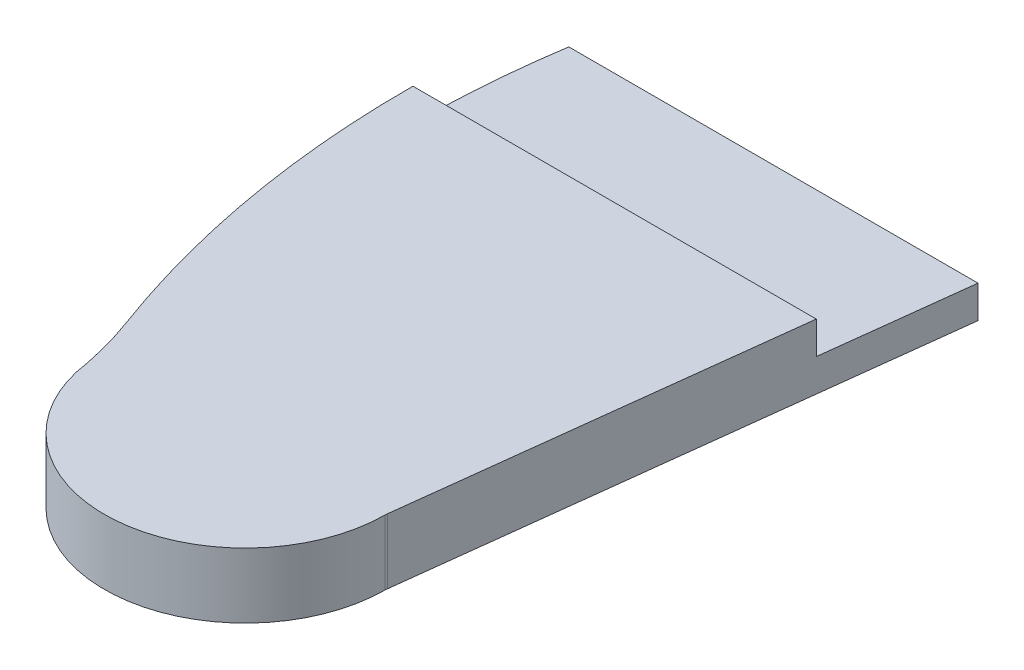
ISO-10303-21;
HEADER;
FILE_DESCRIPTION(('STEP AP214'),'2;1');
FILE_NAME('part.step','',(''),(''),'','','');
FILE_SCHEMA(('AUTOMOTIVE_DESIGN { 1 0 10303 214 1 1 1 1 }'));
ENDSEC;
DATA;
#1=APPLICATION_CONTEXT('core data for automotive mechanical design processes');
#2=APPLICATION_PROTOCOL_DEFINITION('international standard','automotive_design',2000,#1);
#3=PRODUCT_CONTEXT('',#1,'mechanical');
#4=PRODUCT('Part','Part','',(#3));
#5=PRODUCT_RELATED_PRODUCT_CATEGORY('part','',(#4));
#6=PRODUCT_DEFINITION_FORMATION('','',#4);
#7=PRODUCT_DEFINITION_CONTEXT('part definition',#1,'design');
#8=PRODUCT_DEFINITION('design','',#6,#7);
#9=PRODUCT_DEFINITION_SHAPE('','',#8);
#10=(LENGTH_UNIT() NAMED_UNIT(*) SI_UNIT(.MILLI.,.METRE.));
#11=(NAMED_UNIT(*) PLANE_ANGLE_UNIT() SI_UNIT($,.RADIAN.));
#12=(NAMED_UNIT(*) SI_UNIT($,.STERADIAN.) SOLID_ANGLE_UNIT());
#13=UNCERTAINTY_MEASURE_WITH_UNIT(LENGTH_MEASURE(1.E-05),#10,'distance_accuracy_value','');
#14=(GEOMETRIC_REPRESENTATION_CONTEXT(3) GLOBAL_UNCERTAINTY_ASSIGNED_CONTEXT((#13)) GLOBAL_UNIT_ASSIGNED_CONTEXT((#10,
#11,#12)) REPRESENTATION_CONTEXT('',''));
#15=CARTESIAN_POINT('',(0.,0.,0.));
#16=DIRECTION('',(0.,0.,1.));
#17=DIRECTION('',(1.,0.,0.));
#18=AXIS2_PLACEMENT_3D('',#15,#16,#17);
#19=CARTESIAN_POINT('',(113.450621235206,21.75,99.8017663174114));
#20=DIRECTION('',(0.992936608383073,0.,0.118646077612034));
#21=DIRECTION('',(0.118646077612034,0.,-0.992936608383073));
#22=AXIS2_PLACEMENT_3D('',#19,#20,#21);
#23=PLANE('',#22);
#24=DIRECTION('',(0.,-1.,0.));
#25=VECTOR('',#24,1.);
#26=CARTESIAN_POINT('',(105.254766199258,21.75,168.392019497163));
#27=LINE('',#26,#25);
#28=CARTESIAN_POINT('',(105.254766199258,21.75,168.392019497163));
#29=VERTEX_POINT('',#28);
#30=CARTESIAN_POINT('',(105.254766199258,15.,168.392019497163));
#31=VERTEX_POINT('',#30);
#32=EDGE_CURVE('E119',#29,#31,#27,.T.);
#33=ORIENTED_EDGE('',*,*,#32,.F.);
#34=DIRECTION('',(-0.118646077612034,0.,0.992936608383073));
#35=VECTOR('',#34,1.);
#36=CARTESIAN_POINT('',(113.450621235206,21.75,99.8017663174114));
#37=LINE('',#36,#35);
#38=CARTESIAN_POINT('',(95.7499989352653,21.75,247.936422148546));
#39=VERTEX_POINT('',#38);
#40=EDGE_CURVE('E147',#29,#39,#37,.T.);
#41=ORIENTED_EDGE('',*,*,#40,.T.);
#42=DIRECTION('',(0.,-1.,0.));
#43=VECTOR('',#42,1.);
#44=CARTESIAN_POINT('',(95.7499989352653,21.75,247.936422148546));
#45=LINE('',#44,#43);
#46=CARTESIAN_POINT('',(95.7499989352653,8.25,247.936422148546));
#47=VERTEX_POINT('',#46);
#48=EDGE_CURVE('E169',#39,#47,#45,.T.);
#49=ORIENTED_EDGE('',*,*,#48,.T.);
#50=DIRECTION('',(-0.118646077612034,0.,0.992936608383073));
#51=VECTOR('',#50,1.);
#52=CARTESIAN_POINT('',(113.450621235206,8.25,99.8017663174114));
#53=LINE('',#52,#51);
#54=CARTESIAN_POINT('',(108.839468685106,8.25,138.392019497163));
#55=VERTEX_POINT('',#54);
#56=EDGE_CURVE('E164',#55,#47,#53,.T.);
#57=ORIENTED_EDGE('',*,*,#56,.F.);
#58=DIRECTION('',(0.,1.,0.));
#59=VECTOR('',#58,1.);
#60=CARTESIAN_POINT('',(108.839468685106,21.75,138.392019497163));
#61=LINE('',#60,#59);
#62=CARTESIAN_POINT('',(108.839468685106,15.,138.392019497163));
#63=VERTEX_POINT('',#62);
#64=EDGE_CURVE('E62',#55,#63,#61,.T.);
#65=ORIENTED_EDGE('',*,*,#64,.T.);
#66=DIRECTION('',(0.118646077612034,0.,-0.992936608383073));
#67=VECTOR('',#66,1.);
#68=CARTESIAN_POINT('',(113.450621235206,15.,99.8017663174114));
#69=LINE('',#68,#67);
#70=EDGE_CURVE('E55',#31,#63,#69,.T.);
#71=ORIENTED_EDGE('',*,*,#70,.F.);
#72=EDGE_LOOP('',(#33,#41,#49,#57,#65,#71));
#73=FACE_BOUND('',#72,.T.);
#74=ADVANCED_FACE('F40',(#73),#23,.T.);
#75=CARTESIAN_POINT('',(226.607768194537,21.75,169.442885886238));
#76=DIRECTION('',(0.,-1.,0.));
#77=DIRECTION('',(0.,0.,-1.));
#78=AXIS2_PLACEMENT_3D('',#75,#76,#77);
#79=CYLINDRICAL_SURFACE('',#78,205.108590526185);
#80=CARTESIAN_POINT('',(226.607768194537,21.75,169.442885886238));
#81=DIRECTION('',(0.,1.,0.));
#82=DIRECTION('',(0.,0.,1.));
#83=AXIS2_PLACEMENT_3D('',#80,#81,#82);
#84=CIRCLE('',#83,205.108590526185);
#85=CARTESIAN_POINT('',(21.5018697238431,21.75,168.392019497163));
#86=VERTEX_POINT('',#85);
#87=CARTESIAN_POINT('',(34.1785546048209,21.75,240.439587674995));
#88=VERTEX_POINT('',#87);
#89=EDGE_CURVE('E124',#86,#88,#84,.T.);
#90=ORIENTED_EDGE('',*,*,#89,.F.);
#91=DIRECTION('',(0.,-1.,0.));
#92=VECTOR('',#91,1.);
#93=CARTESIAN_POINT('',(21.5018697238431,21.75,168.392019497163));
#94=LINE('',#93,#92);
#95=CARTESIAN_POINT('',(21.5018697238431,15.,168.392019497163));
#96=VERTEX_POINT('',#95);
#97=EDGE_CURVE('E116',#86,#96,#94,.T.);
#98=ORIENTED_EDGE('',*,*,#97,.T.);
#99=CARTESIAN_POINT('',(226.607768194537,15.,169.442885886238));
#100=DIRECTION('',(0.,-1.,0.));
#101=DIRECTION('',(0.,0.,-1.));
#102=AXIS2_PLACEMENT_3D('',#99,#100,#101);
#103=CIRCLE('',#102,205.108590526185);
#104=CARTESIAN_POINT('',(23.8631564187217,15.,138.392019497163));
#105=VERTEX_POINT('',#104);
#106=EDGE_CURVE('E104',#96,#105,#103,.T.);
#107=ORIENTED_EDGE('',*,*,#106,.T.);
#108=DIRECTION('',(0.,-1.,0.));
#109=VECTOR('',#108,1.);
#110=CARTESIAN_POINT('',(23.8631564187217,21.75,138.392019497163));
#111=LINE('',#110,#109);
#112=CARTESIAN_POINT('',(23.8631564187217,8.25,138.392019497163));
#113=VERTEX_POINT('',#112);
#114=EDGE_CURVE('E126',#113,#105,#111,.F.);
#115=ORIENTED_EDGE('',*,*,#114,.F.);
#116=CARTESIAN_POINT('',(226.607768194537,8.25,169.442885886238));
#117=DIRECTION('',(0.,1.,0.));
#118=DIRECTION('',(0.,0.,1.));
#119=AXIS2_PLACEMENT_3D('',#116,#117,#118);
#120=CIRCLE('',#119,205.108590526185);
#121=CARTESIAN_POINT('',(34.1785546048209,8.25,240.439587674995));
#122=VERTEX_POINT('',#121);
#123=EDGE_CURVE('E139',#113,#122,#120,.T.);
#124=ORIENTED_EDGE('',*,*,#123,.T.);
#125=DIRECTION('',(0.,-1.,0.));
#126=VECTOR('',#125,1.);
#127=CARTESIAN_POINT('',(34.1785546048209,21.75,240.439587674995));
#128=LINE('',#127,#126);
#129=EDGE_CURVE('E150',#88,#122,#128,.T.);
#130=ORIENTED_EDGE('',*,*,#129,.F.);
#131=EDGE_LOOP('',(#90,#98,#107,#115,#124,#130));
#132=FACE_BOUND('',#131,.T.);
#133=ADVANCED_FACE('F122',(#132),#79,.T.);
#134=CARTESIAN_POINT('',(37.2193540619975,21.75,90.6928858862381));
#135=DIRECTION('',(0.,1.,0.));
#136=DIRECTION('',(0.,0.,1.));
#137=AXIS2_PLACEMENT_3D('',#134,#135,#136);
#138=PLANE('',#137);
#139=DIRECTION('',(1.,0.,0.));
#140=VECTOR('',#139,1.);
#141=CARTESIAN_POINT('',(21.4991776683519,21.75,168.392019497163));
#142=LINE('',#141,#140);
#143=EDGE_CURVE('E112',#86,#29,#142,.T.);
#144=ORIENTED_EDGE('',*,*,#143,.F.);
#145=ORIENTED_EDGE('',*,*,#89,.T.);
#146=CARTESIAN_POINT('',(37.9207497333752,21.75,254.559964563918));
#147=CARTESIAN_POINT('',(36.7611745636568,21.75,247.335944745943));
#148=CARTESIAN_POINT('',(34.1785546048209,21.75,240.439587674995));
#149=B_SPLINE_CURVE_WITH_KNOTS('',2,(#146,#147,#148),.UNSPECIFIED.,.F.,.F.,(3,3),(0.,1.),.UNSPECIFIED.);
#150=CARTESIAN_POINT('',(37.4786449664301,21.75,252.078923217014));
#151=VERTEX_POINT('',#150);
#152=EDGE_CURVE('E132',#151,#88,#149,.T.);
#153=ORIENTED_EDGE('',*,*,#152,.F.);
#154=CARTESIAN_POINT('',(66.4693540619976,21.75,248.192885886238));
#155=DIRECTION('',(0.,1.,0.));
#156=DIRECTION('',(0.,0.,1.));
#157=AXIS2_PLACEMENT_3D('',#154,#155,#156);
#158=CIRCLE('',#157,29.2500000000001);
#159=CARTESIAN_POINT('',(95.718365724857,21.75,248.433337016259));
#160=VERTEX_POINT('',#159);
#161=EDGE_CURVE('E138',#151,#160,#158,.T.);
#162=ORIENTED_EDGE('',*,*,#161,.T.);
#163=CARTESIAN_POINT('',(100.218213672989,21.75,248.4703294978));
#164=DIRECTION('',(0.,1.,0.));
#165=DIRECTION('',(0.,0.,1.));
#166=AXIS2_PLACEMENT_3D('',#163,#164,#165);
#167=CIRCLE('',#166,4.49999999999999);
#168=EDGE_CURVE('E144',#39,#160,#167,.T.);
#169=ORIENTED_EDGE('',*,*,#168,.F.);
#170=ORIENTED_EDGE('',*,*,#40,.F.);
#171=EDGE_LOOP('',(#144,#145,#153,#162,#169,#170));
#172=FACE_BOUND('',#171,.T.);
#173=ADVANCED_FACE('F186',(#172),#138,.T.);
#174=CARTESIAN_POINT('',(37.2193540619975,8.25,90.6928858862381));
#175=DIRECTION('',(0.,1.,0.));
#176=DIRECTION('',(0.,0.,1.));
#177=AXIS2_PLACEMENT_3D('',#174,#175,#176);
#178=PLANE('',#177);
#179=DIRECTION('',(-1.,0.,0.));
#180=VECTOR('',#179,1.);
#181=CARTESIAN_POINT('',(37.2193540619975,8.25,138.392019497163));
#182=LINE('',#181,#180);
#183=EDGE_CURVE('E49',#55,#113,#182,.T.);
#184=ORIENTED_EDGE('',*,*,#183,.F.);
#185=ORIENTED_EDGE('',*,*,#56,.T.);
#186=CARTESIAN_POINT('',(100.218213672989,8.25,248.4703294978));
#187=DIRECTION('',(0.,1.,0.));
#188=DIRECTION('',(0.,0.,1.));
#189=AXIS2_PLACEMENT_3D('',#186,#187,#188);
#190=CIRCLE('',#189,4.49999999999999);
#191=CARTESIAN_POINT('',(95.718365724857,8.25,248.433337016259));
#192=VERTEX_POINT('',#191);
#193=EDGE_CURVE('E161',#47,#192,#190,.T.);
#194=ORIENTED_EDGE('',*,*,#193,.T.);
#195=CARTESIAN_POINT('',(66.4693540619976,8.25,248.192885886238));
#196=DIRECTION('',(0.,1.,0.));
#197=DIRECTION('',(0.,0.,1.));
#198=AXIS2_PLACEMENT_3D('',#195,#196,#197);
#199=CIRCLE('',#198,29.2500000000001);
#200=CARTESIAN_POINT('',(37.4786449664301,8.25,252.078923217014));
#201=VERTEX_POINT('',#200);
#202=EDGE_CURVE('E155',#201,#192,#199,.T.);
#203=ORIENTED_EDGE('',*,*,#202,.F.);
#204=CARTESIAN_POINT('',(37.9207497333752,8.25,254.559964563918));
#205=CARTESIAN_POINT('',(36.7611745636568,8.25,247.335944745943));
#206=CARTESIAN_POINT('',(34.1785546048209,8.25,240.439587674995));
#207=B_SPLINE_CURVE_WITH_KNOTS('',2,(#204,#205,#206),.UNSPECIFIED.,.F.,.F.,(3,3),(0.,1.),.UNSPECIFIED.);
#208=EDGE_CURVE('E131',#201,#122,#207,.T.);
#209=ORIENTED_EDGE('',*,*,#208,.T.);
#210=ORIENTED_EDGE('',*,*,#123,.F.);
#211=EDGE_LOOP('',(#184,#185,#194,#203,#209,#210));
#212=FACE_BOUND('',#211,.T.);
#213=ADVANCED_FACE('F179',(#212),#178,.F.);
#214=DIRECTION('',(0.,-1.,0.));
#215=VECTOR('',#214,1.);
#216=SURFACE_OF_LINEAR_EXTRUSION('',#149,#215);
#217=ORIENTED_EDGE('',*,*,#208,.F.);
#218=DIRECTION('',(0.,-1.,0.));
#219=VECTOR('',#218,1.);
#220=CARTESIAN_POINT('',(37.4786449664301,21.75,252.078923217014));
#221=LINE('',#220,#219);
#222=EDGE_CURVE('E174',#151,#201,#221,.T.);
#223=ORIENTED_EDGE('',*,*,#222,.F.);
#224=ORIENTED_EDGE('',*,*,#152,.T.);
#225=ORIENTED_EDGE('',*,*,#129,.T.);
#226=EDGE_LOOP('',(#217,#223,#224,#225));
#227=FACE_BOUND('',#226,.T.);
#228=ADVANCED_FACE('F42',(#227),#216,.T.);
#229=CARTESIAN_POINT('',(66.4693540619976,21.75,248.192885886238));
#230=DIRECTION('',(0.,-1.,0.));
#231=DIRECTION('',(0.,0.,-1.));
#232=AXIS2_PLACEMENT_3D('',#229,#230,#231);
#233=CYLINDRICAL_SURFACE('',#232,29.2500000000001);
#234=ORIENTED_EDGE('',*,*,#202,.T.);
#235=DIRECTION('',(0.,-1.,0.));
#236=VECTOR('',#235,1.);
#237=CARTESIAN_POINT('',(95.718365724857,21.75,248.433337016259));
#238=LINE('',#237,#236);
#239=EDGE_CURVE('E172',#160,#192,#238,.T.);
#240=ORIENTED_EDGE('',*,*,#239,.F.);
#241=ORIENTED_EDGE('',*,*,#161,.F.);
#242=ORIENTED_EDGE('',*,*,#222,.T.);
#243=EDGE_LOOP('',(#234,#240,#241,#242));
#244=FACE_BOUND('',#243,.T.);
#245=ADVANCED_FACE('F197',(#244),#233,.T.);
#246=CARTESIAN_POINT('',(100.218213672989,21.75,248.4703294978));
#247=DIRECTION('',(0.,-1.,0.));
#248=DIRECTION('',(0.,0.,-1.));
#249=AXIS2_PLACEMENT_3D('',#246,#247,#248);
#250=CYLINDRICAL_SURFACE('',#249,4.49999999999999);
#251=ORIENTED_EDGE('',*,*,#193,.F.);
#252=ORIENTED_EDGE('',*,*,#48,.F.);
#253=ORIENTED_EDGE('',*,*,#168,.T.);
#254=ORIENTED_EDGE('',*,*,#239,.T.);
#255=EDGE_LOOP('',(#251,#252,#253,#254));
#256=FACE_BOUND('',#255,.T.);
#257=ADVANCED_FACE('F195',(#256),#250,.F.);
#258=CARTESIAN_POINT('',(123.979143601082,21.75,138.392019497163));
#259=DIRECTION('',(0.,0.,-1.));
#260=DIRECTION('',(-1.,0.,0.));
#261=AXIS2_PLACEMENT_3D('',#258,#259,#260);
#262=PLANE('',#261);
#263=DIRECTION('',(-1.,0.,0.));
#264=VECTOR('',#263,1.);
#265=CARTESIAN_POINT('',(123.979143601082,15.,138.392019497163));
#266=LINE('',#265,#264);
#267=EDGE_CURVE('E11',#63,#105,#266,.T.);
#268=ORIENTED_EDGE('',*,*,#267,.F.);
#269=ORIENTED_EDGE('',*,*,#64,.F.);
#270=ORIENTED_EDGE('',*,*,#183,.T.);
#271=ORIENTED_EDGE('',*,*,#114,.T.);
#272=EDGE_LOOP('',(#268,#269,#270,#271));
#273=FACE_BOUND('',#272,.T.);
#274=ADVANCED_FACE('F175',(#273),#262,.T.);
#275=CARTESIAN_POINT('',(21.4991776683519,15.,168.392019497163));
#276=DIRECTION('',(0.,0.,1.));
#277=DIRECTION('',(1.,0.,0.));
#278=AXIS2_PLACEMENT_3D('',#275,#276,#277);
#279=PLANE('',#278);
#280=ORIENTED_EDGE('',*,*,#32,.T.);
#281=DIRECTION('',(1.,0.,0.));
#282=VECTOR('',#281,1.);
#283=CARTESIAN_POINT('',(21.4991776683519,15.,168.392019497163));
#284=LINE('',#283,#282);
#285=EDGE_CURVE('E107',#96,#31,#284,.T.);
#286=ORIENTED_EDGE('',*,*,#285,.F.);
#287=ORIENTED_EDGE('',*,*,#97,.F.);
#288=ORIENTED_EDGE('',*,*,#143,.T.);
#289=EDGE_LOOP('',(#280,#286,#287,#288));
#290=FACE_BOUND('',#289,.T.);
#291=ADVANCED_FACE('F115',(#290),#279,.F.);
#292=CARTESIAN_POINT('',(21.4991776683519,15.,168.392019497163));
#293=DIRECTION('',(0.,-1.,0.));
#294=DIRECTION('',(0.,0.,-1.));
#295=AXIS2_PLACEMENT_3D('',#292,#293,#294);
#296=PLANE('',#295);
#297=ORIENTED_EDGE('',*,*,#70,.T.);
#298=ORIENTED_EDGE('',*,*,#267,.T.);
#299=ORIENTED_EDGE('',*,*,#106,.F.);
#300=ORIENTED_EDGE('',*,*,#285,.T.);
#301=EDGE_LOOP('',(#297,#298,#299,#300));
#302=FACE_BOUND('',#301,.T.);
#303=ADVANCED_FACE('F106',(#302),#296,.F.);
#304=CLOSED_SHELL('',(#74,#133,#173,#213,#228,#245,#257,#274,#291,#303));
#305=MANIFOLD_SOLID_BREP('B2',#304);
#306=ADVANCED_BREP_SHAPE_REPRESENTATION('',(#18,#305),#14);
#307=SHAPE_DEFINITION_REPRESENTATION(#9,#306);
ENDSEC;
END-ISO-10303-21;
